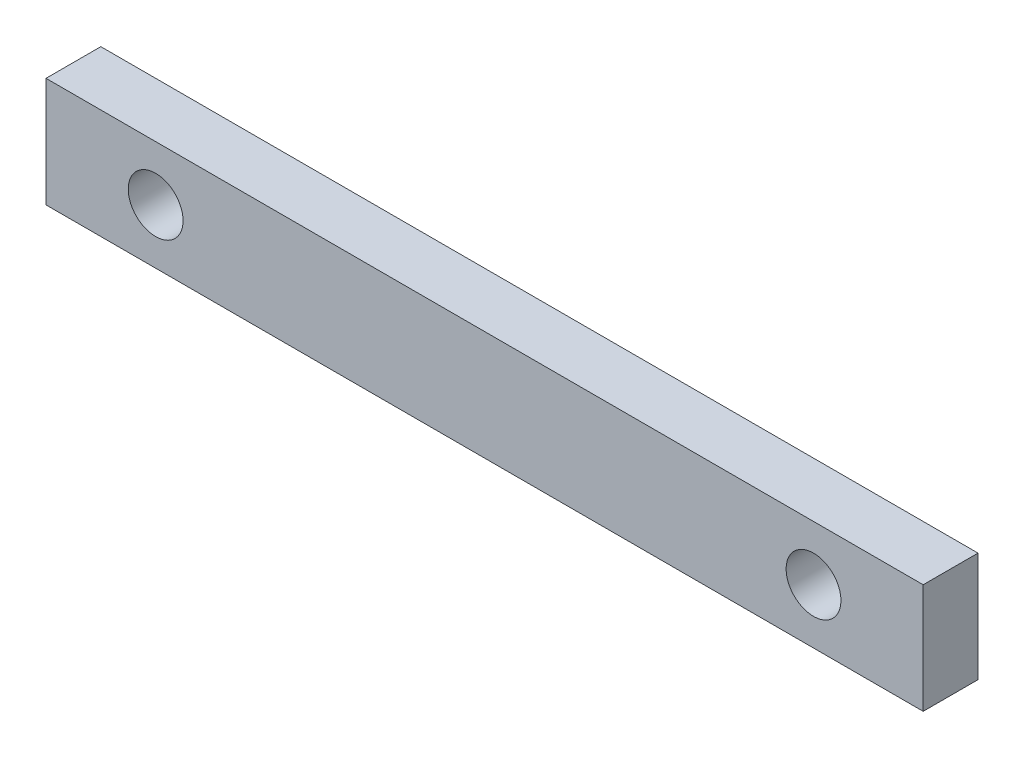
ISO-10303-21;
HEADER;
FILE_DESCRIPTION(('STEP AP214'),'2;1');
FILE_NAME('part.step','',(''),(''),'','','');
FILE_SCHEMA(('AUTOMOTIVE_DESIGN { 1 0 10303 214 1 1 1 1 }'));
ENDSEC;
DATA;
#1=APPLICATION_CONTEXT('core data for automotive mechanical design processes');
#2=APPLICATION_PROTOCOL_DEFINITION('international standard','automotive_design',2000,#1);
#3=PRODUCT_CONTEXT('',#1,'mechanical');
#4=PRODUCT('Part','Part','',(#3));
#5=PRODUCT_RELATED_PRODUCT_CATEGORY('part','',(#4));
#6=PRODUCT_DEFINITION_FORMATION('','',#4);
#7=PRODUCT_DEFINITION_CONTEXT('part definition',#1,'design');
#8=PRODUCT_DEFINITION('design','',#6,#7);
#9=PRODUCT_DEFINITION_SHAPE('','',#8);
#10=(LENGTH_UNIT() NAMED_UNIT(*) SI_UNIT(.MILLI.,.METRE.));
#11=(NAMED_UNIT(*) PLANE_ANGLE_UNIT() SI_UNIT($,.RADIAN.));
#12=(NAMED_UNIT(*) SI_UNIT($,.STERADIAN.) SOLID_ANGLE_UNIT());
#13=UNCERTAINTY_MEASURE_WITH_UNIT(LENGTH_MEASURE(1.E-05),#10,'distance_accuracy_value','');
#14=(GEOMETRIC_REPRESENTATION_CONTEXT(3) GLOBAL_UNCERTAINTY_ASSIGNED_CONTEXT((#13)) GLOBAL_UNIT_ASSIGNED_CONTEXT((#10,
#11,#12)) REPRESENTATION_CONTEXT('',''));
#15=CARTESIAN_POINT('',(0.,0.,0.));
#16=DIRECTION('',(0.,0.,1.));
#17=DIRECTION('',(1.,0.,0.));
#18=AXIS2_PLACEMENT_3D('',#15,#16,#17);
#19=CARTESIAN_POINT('',(0.,0.,5.));
#20=DIRECTION('',(0.,0.,1.));
#21=DIRECTION('',(1.,0.,0.));
#22=AXIS2_PLACEMENT_3D('',#19,#20,#21);
#23=PLANE('',#22);
#24=CARTESIAN_POINT('',(-30.,0.,5.));
#25=DIRECTION('',(0.,0.,1.));
#26=DIRECTION('',(1.,0.,0.));
#27=AXIS2_PLACEMENT_3D('',#24,#25,#26);
#28=CIRCLE('',#27,2.49999999999999);
#29=CARTESIAN_POINT('',(-27.5,0.,5.));
#30=VERTEX_POINT('',#29);
#31=EDGE_CURVE('E100',#30,#30,#28,.T.);
#32=ORIENTED_EDGE('',*,*,#31,.F.);
#33=EDGE_LOOP('',(#32));
#34=FACE_BOUND('',#33,.T.);
#35=DIRECTION('',(0.,1.,0.));
#36=VECTOR('',#35,1.);
#37=CARTESIAN_POINT('',(40.,5.,5.));
#38=LINE('',#37,#36);
#39=CARTESIAN_POINT('',(40.,-5.,5.));
#40=VERTEX_POINT('',#39);
#41=CARTESIAN_POINT('',(40.,5.,5.));
#42=VERTEX_POINT('',#41);
#43=EDGE_CURVE('E85',#40,#42,#38,.T.);
#44=ORIENTED_EDGE('',*,*,#43,.T.);
#45=DIRECTION('',(-1.,0.,0.));
#46=VECTOR('',#45,1.);
#47=CARTESIAN_POINT('',(-40.,5.,5.));
#48=LINE('',#47,#46);
#49=CARTESIAN_POINT('',(-40.,5.,5.));
#50=VERTEX_POINT('',#49);
#51=EDGE_CURVE('E80',#42,#50,#48,.T.);
#52=ORIENTED_EDGE('',*,*,#51,.T.);
#53=DIRECTION('',(0.,-1.,0.));
#54=VECTOR('',#53,1.);
#55=CARTESIAN_POINT('',(-40.,5.,5.));
#56=LINE('',#55,#54);
#57=CARTESIAN_POINT('',(-40.,-5.,5.));
#58=VERTEX_POINT('',#57);
#59=EDGE_CURVE('E83',#50,#58,#56,.T.);
#60=ORIENTED_EDGE('',*,*,#59,.T.);
#61=DIRECTION('',(1.,0.,0.));
#62=VECTOR('',#61,1.);
#63=CARTESIAN_POINT('',(-40.,-5.,5.));
#64=LINE('',#63,#62);
#65=EDGE_CURVE('E50',#58,#40,#64,.T.);
#66=ORIENTED_EDGE('',*,*,#65,.T.);
#67=EDGE_LOOP('',(#44,#52,#60,#66));
#68=FACE_BOUND('',#67,.T.);
#69=CARTESIAN_POINT('',(30.,0.,5.));
#70=DIRECTION('',(0.,0.,1.));
#71=DIRECTION('',(-1.,0.,0.));
#72=AXIS2_PLACEMENT_3D('',#69,#70,#71);
#73=CIRCLE('',#72,2.49999999999999);
#74=CARTESIAN_POINT('',(27.5,0.,5.));
#75=VERTEX_POINT('',#74);
#76=EDGE_CURVE('E115',#75,#75,#73,.T.);
#77=ORIENTED_EDGE('',*,*,#76,.F.);
#78=EDGE_LOOP('',(#77));
#79=FACE_BOUND('',#78,.T.);
#80=ADVANCED_FACE('F33',(#34,#68,#79),#23,.T.);
#81=CARTESIAN_POINT('',(0.,0.,0.));
#82=DIRECTION('',(0.,0.,1.));
#83=DIRECTION('',(1.,0.,0.));
#84=AXIS2_PLACEMENT_3D('',#81,#82,#83);
#85=PLANE('',#84);
#86=DIRECTION('',(0.,1.,0.));
#87=VECTOR('',#86,1.);
#88=CARTESIAN_POINT('',(40.,5.,0.));
#89=LINE('',#88,#87);
#90=CARTESIAN_POINT('',(40.,-5.,0.));
#91=VERTEX_POINT('',#90);
#92=CARTESIAN_POINT('',(40.,5.,0.));
#93=VERTEX_POINT('',#92);
#94=EDGE_CURVE('E97',#91,#93,#89,.T.);
#95=ORIENTED_EDGE('',*,*,#94,.F.);
#96=DIRECTION('',(1.,0.,0.));
#97=VECTOR('',#96,1.);
#98=CARTESIAN_POINT('',(-40.,-5.,0.));
#99=LINE('',#98,#97);
#100=CARTESIAN_POINT('',(-40.,-5.,0.));
#101=VERTEX_POINT('',#100);
#102=EDGE_CURVE('E73',#101,#91,#99,.T.);
#103=ORIENTED_EDGE('',*,*,#102,.F.);
#104=DIRECTION('',(0.,-1.,0.));
#105=VECTOR('',#104,1.);
#106=CARTESIAN_POINT('',(-40.,5.,0.));
#107=LINE('',#106,#105);
#108=CARTESIAN_POINT('',(-40.,5.,0.));
#109=VERTEX_POINT('',#108);
#110=EDGE_CURVE('E67',#109,#101,#107,.T.);
#111=ORIENTED_EDGE('',*,*,#110,.F.);
#112=DIRECTION('',(-1.,0.,0.));
#113=VECTOR('',#112,1.);
#114=CARTESIAN_POINT('',(-40.,5.,0.));
#115=LINE('',#114,#113);
#116=EDGE_CURVE('E89',#93,#109,#115,.T.);
#117=ORIENTED_EDGE('',*,*,#116,.F.);
#118=EDGE_LOOP('',(#95,#103,#111,#117));
#119=FACE_BOUND('',#118,.T.);
#120=CARTESIAN_POINT('',(-30.,0.,0.));
#121=DIRECTION('',(0.,0.,1.));
#122=DIRECTION('',(1.,0.,0.));
#123=AXIS2_PLACEMENT_3D('',#120,#121,#122);
#124=CIRCLE('',#123,2.49999999999999);
#125=CARTESIAN_POINT('',(-27.5,0.,0.));
#126=VERTEX_POINT('',#125);
#127=EDGE_CURVE('E112',#126,#126,#124,.T.);
#128=ORIENTED_EDGE('',*,*,#127,.T.);
#129=EDGE_LOOP('',(#128));
#130=FACE_BOUND('',#129,.T.);
#131=CARTESIAN_POINT('',(30.,0.,0.));
#132=DIRECTION('',(0.,0.,1.));
#133=DIRECTION('',(-1.,0.,0.));
#134=AXIS2_PLACEMENT_3D('',#131,#132,#133);
#135=CIRCLE('',#134,2.49999999999999);
#136=CARTESIAN_POINT('',(27.5,0.,0.));
#137=VERTEX_POINT('',#136);
#138=EDGE_CURVE('E118',#137,#137,#135,.T.);
#139=ORIENTED_EDGE('',*,*,#138,.T.);
#140=EDGE_LOOP('',(#139));
#141=FACE_BOUND('',#140,.T.);
#142=ADVANCED_FACE('F108',(#119,#130,#141),#85,.F.);
#143=CARTESIAN_POINT('',(40.,5.,5.));
#144=DIRECTION('',(-1.,0.,0.));
#145=DIRECTION('',(0.,0.,1.));
#146=AXIS2_PLACEMENT_3D('',#143,#144,#145);
#147=PLANE('',#146);
#148=ORIENTED_EDGE('',*,*,#94,.T.);
#149=DIRECTION('',(0.,0.,-1.));
#150=VECTOR('',#149,1.);
#151=CARTESIAN_POINT('',(40.,5.,5.));
#152=LINE('',#151,#150);
#153=EDGE_CURVE('E11',#42,#93,#152,.T.);
#154=ORIENTED_EDGE('',*,*,#153,.F.);
#155=ORIENTED_EDGE('',*,*,#43,.F.);
#156=DIRECTION('',(0.,0.,-1.));
#157=VECTOR('',#156,1.);
#158=CARTESIAN_POINT('',(40.,-5.,5.));
#159=LINE('',#158,#157);
#160=EDGE_CURVE('E93',#40,#91,#159,.T.);
#161=ORIENTED_EDGE('',*,*,#160,.T.);
#162=EDGE_LOOP('',(#148,#154,#155,#161));
#163=FACE_BOUND('',#162,.T.);
#164=ADVANCED_FACE('F35',(#163),#147,.F.);
#165=CARTESIAN_POINT('',(-40.,5.,5.));
#166=DIRECTION('',(0.,-1.,0.));
#167=DIRECTION('',(1.,0.,0.));
#168=AXIS2_PLACEMENT_3D('',#165,#166,#167);
#169=PLANE('',#168);
#170=ORIENTED_EDGE('',*,*,#116,.T.);
#171=DIRECTION('',(0.,0.,-1.));
#172=VECTOR('',#171,1.);
#173=CARTESIAN_POINT('',(-40.,5.,5.));
#174=LINE('',#173,#172);
#175=EDGE_CURVE('E42',#50,#109,#174,.T.);
#176=ORIENTED_EDGE('',*,*,#175,.F.);
#177=ORIENTED_EDGE('',*,*,#51,.F.);
#178=ORIENTED_EDGE('',*,*,#153,.T.);
#179=EDGE_LOOP('',(#170,#176,#177,#178));
#180=FACE_BOUND('',#179,.T.);
#181=ADVANCED_FACE('F88',(#180),#169,.F.);
#182=CARTESIAN_POINT('',(-40.,5.,5.));
#183=DIRECTION('',(1.,0.,0.));
#184=DIRECTION('',(0.,0.,-1.));
#185=AXIS2_PLACEMENT_3D('',#182,#183,#184);
#186=PLANE('',#185);
#187=ORIENTED_EDGE('',*,*,#110,.T.);
#188=DIRECTION('',(0.,0.,-1.));
#189=VECTOR('',#188,1.);
#190=CARTESIAN_POINT('',(-40.,-5.,5.));
#191=LINE('',#190,#189);
#192=EDGE_CURVE('E90',#58,#101,#191,.T.);
#193=ORIENTED_EDGE('',*,*,#192,.F.);
#194=ORIENTED_EDGE('',*,*,#59,.F.);
#195=ORIENTED_EDGE('',*,*,#175,.T.);
#196=EDGE_LOOP('',(#187,#193,#194,#195));
#197=FACE_BOUND('',#196,.T.);
#198=ADVANCED_FACE('F91',(#197),#186,.F.);
#199=CARTESIAN_POINT('',(-40.,-5.,5.));
#200=DIRECTION('',(0.,1.,0.));
#201=DIRECTION('',(0.,0.,1.));
#202=AXIS2_PLACEMENT_3D('',#199,#200,#201);
#203=PLANE('',#202);
#204=ORIENTED_EDGE('',*,*,#102,.T.);
#205=ORIENTED_EDGE('',*,*,#160,.F.);
#206=ORIENTED_EDGE('',*,*,#65,.F.);
#207=ORIENTED_EDGE('',*,*,#192,.T.);
#208=EDGE_LOOP('',(#204,#205,#206,#207));
#209=FACE_BOUND('',#208,.T.);
#210=ADVANCED_FACE('F105',(#209),#203,.F.);
#211=CARTESIAN_POINT('',(-30.,0.,5.));
#212=DIRECTION('',(0.,0.,-1.));
#213=DIRECTION('',(-1.,0.,0.));
#214=AXIS2_PLACEMENT_3D('',#211,#212,#213);
#215=CYLINDRICAL_SURFACE('',#214,2.49999999999999);
#216=ORIENTED_EDGE('',*,*,#31,.T.);
#217=EDGE_LOOP('',(#216));
#218=FACE_BOUND('',#217,.T.);
#219=ORIENTED_EDGE('',*,*,#127,.F.);
#220=EDGE_LOOP('',(#219));
#221=FACE_BOUND('',#220,.T.);
#222=ADVANCED_FACE('F135',(#218,#221),#215,.F.);
#223=CARTESIAN_POINT('',(30.,0.,5.));
#224=DIRECTION('',(0.,0.,-1.));
#225=DIRECTION('',(-1.,0.,0.));
#226=AXIS2_PLACEMENT_3D('',#223,#224,#225);
#227=CYLINDRICAL_SURFACE('',#226,2.49999999999999);
#228=ORIENTED_EDGE('',*,*,#76,.T.);
#229=EDGE_LOOP('',(#228));
#230=FACE_BOUND('',#229,.T.);
#231=ORIENTED_EDGE('',*,*,#138,.F.);
#232=EDGE_LOOP('',(#231));
#233=FACE_BOUND('',#232,.T.);
#234=ADVANCED_FACE('F124',(#230,#233),#227,.F.);
#235=CLOSED_SHELL('',(#80,#142,#164,#181,#198,#210,#222,#234));
#236=MANIFOLD_SOLID_BREP('B2',#235);
#237=ADVANCED_BREP_SHAPE_REPRESENTATION('',(#18,#236),#14);
#238=SHAPE_DEFINITION_REPRESENTATION(#9,#237);
ENDSEC;
END-ISO-10303-21;
